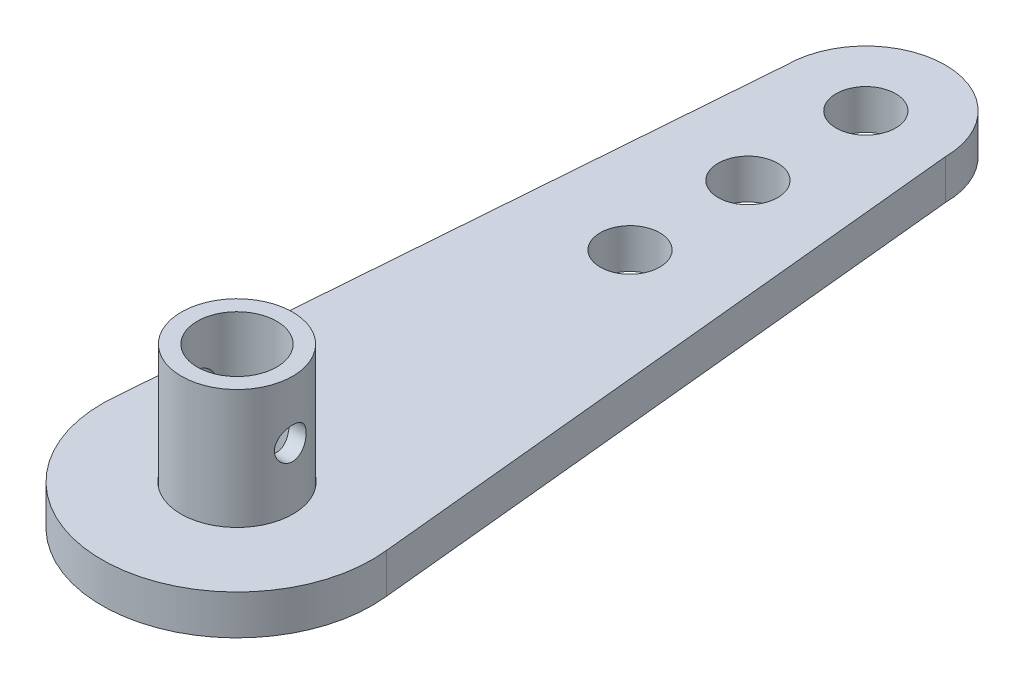
ISO-10303-21;
HEADER;
FILE_DESCRIPTION(('STEP AP214'),'2;1');
FILE_NAME('part.step','',(''),(''),'','','');
FILE_SCHEMA(('AUTOMOTIVE_DESIGN { 1 0 10303 214 1 1 1 1 }'));
ENDSEC;
DATA;
#1=APPLICATION_CONTEXT('core data for automotive mechanical design processes');
#2=APPLICATION_PROTOCOL_DEFINITION('international standard','automotive_design',2000,#1);
#3=PRODUCT_CONTEXT('',#1,'mechanical');
#4=PRODUCT('Part','Part','',(#3));
#5=PRODUCT_RELATED_PRODUCT_CATEGORY('part','',(#4));
#6=PRODUCT_DEFINITION_FORMATION('','',#4);
#7=PRODUCT_DEFINITION_CONTEXT('part definition',#1,'design');
#8=PRODUCT_DEFINITION('design','',#6,#7);
#9=PRODUCT_DEFINITION_SHAPE('','',#8);
#10=(LENGTH_UNIT() NAMED_UNIT(*) SI_UNIT(.MILLI.,.METRE.));
#11=(NAMED_UNIT(*) PLANE_ANGLE_UNIT() SI_UNIT($,.RADIAN.));
#12=(NAMED_UNIT(*) SI_UNIT($,.STERADIAN.) SOLID_ANGLE_UNIT());
#13=UNCERTAINTY_MEASURE_WITH_UNIT(LENGTH_MEASURE(1.E-05),#10,'distance_accuracy_value','');
#14=(GEOMETRIC_REPRESENTATION_CONTEXT(3) GLOBAL_UNCERTAINTY_ASSIGNED_CONTEXT((#13)) GLOBAL_UNIT_ASSIGNED_CONTEXT((#10,
#11,#12)) REPRESENTATION_CONTEXT('',''));
#15=CARTESIAN_POINT('',(0.,0.,0.));
#16=DIRECTION('',(0.,0.,1.));
#17=DIRECTION('',(1.,0.,0.));
#18=AXIS2_PLACEMENT_3D('',#15,#16,#17);
#19=CARTESIAN_POINT('',(0.,-49.5979797464467,0.));
#20=DIRECTION('',(0.,1.,0.));
#21=DIRECTION('',(0.,0.,1.));
#22=AXIS2_PLACEMENT_3D('',#19,#20,#21);
#23=CYLINDRICAL_SURFACE('',#22,14.);
#24=CARTESIAN_POINT('',(-13.4164078649987,15.4,-4.));
#25=CARTESIAN_POINT('',(-13.4164109402242,15.1802969242428,-3.99999604092983));
#26=CARTESIAN_POINT('',(-13.4218635935922,14.9605538314903,-3.98183733199153));
#27=CARTESIAN_POINT('',(-13.443007784134,14.5274575222748,-3.90984726780337));
#28=CARTESIAN_POINT('',(-13.4587034859276,14.3141069417989,-3.85600140272654));
#29=CARTESIAN_POINT('',(-13.4984141904331,13.9001255982568,-3.71458686585747));
#30=CARTESIAN_POINT('',(-13.522416305148,13.6994756963657,-3.62707041303752));
#31=CARTESIAN_POINT('',(-13.5760184219223,13.3156643768913,-3.42096728125872));
#32=CARTESIAN_POINT('',(-13.6056190885037,13.1325050392439,-3.30237691332692));
#33=CARTESIAN_POINT('',(-13.6680356642832,12.7836168693703,-3.03384960196399));
#34=CARTESIAN_POINT('',(-13.700915119283,12.6184643957416,-2.88317842226499));
#35=CARTESIAN_POINT('',(-13.7656393102403,12.3153944333924,-2.55634249093854));
#36=CARTESIAN_POINT('',(-13.797483924673,12.1774801337543,-2.38017475831926));
#37=CARTESIAN_POINT('',(-13.8572666400303,11.930342703293,-2.00329206431518));
#38=CARTESIAN_POINT('',(-13.8851210900173,11.821700760498,-1.80218156752374));
#39=CARTESIAN_POINT('',(-13.9330508097106,11.6399964511681,-1.38361695047928));
#40=CARTESIAN_POINT('',(-13.9531275938173,11.5669271575195,-1.16616602175034));
#41=CARTESIAN_POINT('',(-13.9827903860047,11.4603310775206,-0.727117150242356));
#42=CARTESIAN_POINT('',(-13.992636540226,11.4258219565906,-0.505775596258082));
#43=CARTESIAN_POINT('',(-14.0016419131939,11.3942265322335,-0.0602402048438457));
#44=CARTESIAN_POINT('',(-14.0008031747798,11.3971330753253,0.163953079177104));
#45=CARTESIAN_POINT('',(-13.988720135266,11.439612749836,0.601960391470434));
#46=CARTESIAN_POINT('',(-13.9777774155205,11.4781232252759,0.815887092217865));
#47=CARTESIAN_POINT('',(-13.9470777266033,11.5889902049288,1.23410444435526));
#48=CARTESIAN_POINT('',(-13.9273202211265,11.6613487685244,1.43839450860111));
#49=CARTESIAN_POINT('',(-13.8807806354401,11.8386188016235,1.83414766745775));
#50=CARTESIAN_POINT('',(-13.8539241102349,11.943877555616,2.02544608770119));
#51=CARTESIAN_POINT('',(-13.7960553794886,12.1836891727967,2.38801448718132));
#52=CARTESIAN_POINT('',(-13.765042263868,12.3182484553355,2.55928006483334));
#53=CARTESIAN_POINT('',(-13.7009136603624,12.6184114212345,2.88326529709413));
#54=CARTESIAN_POINT('',(-13.6677625872738,12.7849388672001,3.03512315516461));
#55=CARTESIAN_POINT('',(-13.6040594758538,13.1414301837019,3.30898603150471));
#56=CARTESIAN_POINT('',(-13.5735076485331,13.3313959539352,3.43098862758458));
#57=CARTESIAN_POINT('',(-13.5183034958578,13.7314617689667,3.64246671969374));
#58=CARTESIAN_POINT('',(-13.4937002171629,13.9417104499801,3.73167475570956));
#59=CARTESIAN_POINT('',(-13.4537708861407,14.3751063268812,3.8731790298547));
#60=CARTESIAN_POINT('',(-13.4384421346475,14.5982497492809,3.92548600803625));
#61=CARTESIAN_POINT('',(-13.4193823043332,15.0429608486919,3.99014834401352));
#62=CARTESIAN_POINT('',(-13.415274226443,15.2643236338733,4.00380296315132));
#63=CARTESIAN_POINT('',(-13.4180831918272,15.7061766318346,3.99437993438907));
#64=CARTESIAN_POINT('',(-13.4249988598223,15.9266669500199,3.97130686849173));
#65=CARTESIAN_POINT('',(-13.4487086011028,16.3552824560478,3.89023562851965));
#66=CARTESIAN_POINT('',(-13.4652728593166,16.5635751720308,3.8330492436831));
#67=CARTESIAN_POINT('',(-13.506181278607,16.967603743995,3.6863032373283));
#68=CARTESIAN_POINT('',(-13.5305265622207,17.1633377832912,3.59673894453528));
#69=CARTESIAN_POINT('',(-13.5850037601899,17.5420441504336,3.38523930243255));
#70=CARTESIAN_POINT('',(-13.615263947623,17.7245808884044,3.26255783458265));
#71=CARTESIAN_POINT('',(-13.6778745309961,18.0669527468867,2.98920927369681));
#72=CARTESIAN_POINT('',(-13.7102253789521,18.2267829340243,2.83853611536273));
#73=CARTESIAN_POINT('',(-13.7746945487219,18.5247588365764,2.50741601993112));
#74=CARTESIAN_POINT('',(-13.8067681209229,18.6619899428375,2.3261354204811));
#75=CARTESIAN_POINT('',(-13.8659595409199,18.9040913627655,1.94237061411509));
#76=CARTESIAN_POINT('',(-13.8930776477082,19.0089633678447,1.73988751619636));
#77=CARTESIAN_POINT('',(-13.9391300969281,19.1823685740527,1.32086654591233));
#78=CARTESIAN_POINT('',(-13.9581261625449,19.2511767791723,1.10444959979927));
#79=CARTESIAN_POINT('',(-13.9860667924777,19.3512536038803,0.662491297099843));
#80=CARTESIAN_POINT('',(-13.9950139424605,19.3825318803626,0.436952303170864));
#81=CARTESIAN_POINT('',(-14.0017067000655,19.4059828679956,-0.00835647591804675));
#82=CARTESIAN_POINT('',(-13.9998340717793,19.3994882981657,-0.228051262099872));
#83=CARTESIAN_POINT('',(-13.9859813824433,19.3507234371794,-0.663090344844051));
#84=CARTESIAN_POINT('',(-13.974001805414,19.3084548592357,-0.87843484923522));
#85=CARTESIAN_POINT('',(-13.9413760372002,19.1901372780425,-1.29680826607902));
#86=CARTESIAN_POINT('',(-13.9208082809555,19.1143936421129,-1.49993006686952));
#87=CARTESIAN_POINT('',(-13.873141882877,18.9315476834282,-1.8906944055235));
#88=CARTESIAN_POINT('',(-13.8460422300653,18.8244405058124,-2.07833454116351));
#89=CARTESIAN_POINT('',(-13.7871791087733,18.5782053251535,-2.43886691270561));
#90=CARTESIAN_POINT('',(-13.7553009156092,18.4382198264351,-2.61115465600577));
#91=CARTESIAN_POINT('',(-13.690881299846,18.1317817490802,-2.93024244464514));
#92=CARTESIAN_POINT('',(-13.6583396961736,17.9653218577859,-3.07703542441088));
#93=CARTESIAN_POINT('',(-13.595280750434,17.6054061660498,-3.34481692055405));
#94=CARTESIAN_POINT('',(-13.5648390336962,17.411356105155,-3.46502633435707));
#95=CARTESIAN_POINT('',(-13.5105689049742,17.0049562695349,-3.67095887227717));
#96=CARTESIAN_POINT('',(-13.4867367939819,16.7926168178684,-3.75670129766751));
#97=CARTESIAN_POINT('',(-13.4511691914923,16.3846925995023,-3.88197068027303));
#98=CARTESIAN_POINT('',(-13.4382487767767,16.1906193037863,-3.92611799964084));
#99=CARTESIAN_POINT('',(-13.4208673892336,15.7977077633049,-3.98513214086754));
#100=CARTESIAN_POINT('',(-13.416405081374,15.5988702755402,-4.00000358366114));
#101=CARTESIAN_POINT('',(-13.4164078649987,15.4,-4.));
#102=B_SPLINE_CURVE_WITH_KNOTS('',3,(#24,#25,#26,#27,#28,#29,#30,#31,#32,#33,#34,#35,#36,#37,
#38,#39,#40,#41,#42,#43,#44,#45,#46,#47,#48,#49,#50,#51,#52,#53,#54,#55,#56,#57,#58,#59,#60,#61,
#62,#63,#64,#65,#66,#67,#68,#69,#70,#71,#72,#73,#74,#75,#76,#77,#78,#79,#80,#81,#82,#83,#84,#85,
#86,#87,#88,#89,#90,#91,#92,#93,#94,#95,#96,#97,#98,#99,#100,#101),.UNSPECIFIED.,.T.,.F.,(4,2,2,
2,2,2,2,2,2,2,2,2,2,2,2,2,2,2,2,2,2,2,2,2,2,2,2,2,2,2,2,2,2,2,2,2,2,2,4),(0.,0.658376684727899,
1.31702121923772,1.97464836747287,2.63235362201469,3.30714334413232,3.98201202476966,
4.66942966027692,5.35671338035412,6.02605802057484,6.69527469104836,7.34514075286843,
7.99504635893043,8.65205806756982,9.3092138636967,9.98943225386,10.6697058125952,
11.355410412628,12.0409153559206,12.70308726673,13.3651765740293,14.0121057931906,
14.6591283843812,15.322160120908,15.9853356924624,16.6709077675935,17.3564440017533,
18.0366737060221,18.7167283415931,19.3729379537416,20.0291161418718,20.6794282478446,
21.3298410709248,21.9995953749678,22.6695349983666,23.3570722485049,24.0442239444163,
24.6402657774332,25.2362135230433),.UNSPECIFIED.);
#103=CARTESIAN_POINT('',(-13.4164078649987,15.4,-4.));
#104=VERTEX_POINT('',#103);
#105=EDGE_CURVE('E97',#104,#104,#102,.T.);
#106=ORIENTED_EDGE('',*,*,#105,.F.);
#107=EDGE_LOOP('',(#106));
#108=FACE_BOUND('',#107,.T.);
#109=CARTESIAN_POINT('',(13.4164078649987,15.4,-4.));
#110=CARTESIAN_POINT('',(13.4164109402242,15.6197030757572,-3.99999604092983));
#111=CARTESIAN_POINT('',(13.4218635935922,15.8394461685097,-3.98183733199153));
#112=CARTESIAN_POINT('',(13.443007784134,16.2725424777252,-3.90984726780337));
#113=CARTESIAN_POINT('',(13.4587034859276,16.4858930582011,-3.85600140272654));
#114=CARTESIAN_POINT('',(13.4984141904331,16.8998744017432,-3.71458686585747));
#115=CARTESIAN_POINT('',(13.522416305148,17.1005243036343,-3.62707041303752));
#116=CARTESIAN_POINT('',(13.5760184219223,17.4843356231087,-3.42096728125872));
#117=CARTESIAN_POINT('',(13.6056190885037,17.667494960756,-3.30237691332692));
#118=CARTESIAN_POINT('',(13.6680356642832,18.0163831306297,-3.03384960196399));
#119=CARTESIAN_POINT('',(13.700915119283,18.1815356042584,-2.88317842226499));
#120=CARTESIAN_POINT('',(13.7656393102403,18.4846055666076,-2.55634249093854));
#121=CARTESIAN_POINT('',(13.797483924673,18.6225198662457,-2.38017475831926));
#122=CARTESIAN_POINT('',(13.8572666400303,18.869657296707,-2.00329206431518));
#123=CARTESIAN_POINT('',(13.8851210900173,18.978299239502,-1.80218156752374));
#124=CARTESIAN_POINT('',(13.9330508097106,19.1600035488319,-1.38361695047928));
#125=CARTESIAN_POINT('',(13.9531275938173,19.2330728424805,-1.16616602175035));
#126=CARTESIAN_POINT('',(13.9827903860047,19.3396689224794,-0.72711715024236));
#127=CARTESIAN_POINT('',(13.992636540226,19.3741780434093,-0.505775596258087));
#128=CARTESIAN_POINT('',(14.0016419131939,19.4057734677665,-0.0602402048438502));
#129=CARTESIAN_POINT('',(14.0008031747798,19.4028669246747,0.163953079177099));
#130=CARTESIAN_POINT('',(13.988720135266,19.360387250164,0.60196039147043));
#131=CARTESIAN_POINT('',(13.9777774155205,19.3218767747241,0.815887092217861));
#132=CARTESIAN_POINT('',(13.9470777266033,19.2110097950712,1.23410444435525));
#133=CARTESIAN_POINT('',(13.9273202211265,19.1386512314756,1.43839450860111));
#134=CARTESIAN_POINT('',(13.8807806354401,18.9613811983765,1.83414766745775));
#135=CARTESIAN_POINT('',(13.8539241102349,18.856122444384,2.02544608770119));
#136=CARTESIAN_POINT('',(13.7960553794886,18.6163108272033,2.38801448718132));
#137=CARTESIAN_POINT('',(13.765042263868,18.4817515446645,2.55928006483334));
#138=CARTESIAN_POINT('',(13.7009136603624,18.1815885787654,2.88326529709413));
#139=CARTESIAN_POINT('',(13.6677625872738,18.0150611327999,3.0351231551646));
#140=CARTESIAN_POINT('',(13.6040594758538,17.6585698162981,3.30898603150471));
#141=CARTESIAN_POINT('',(13.5735076485331,17.4686040460648,3.43098862758458));
#142=CARTESIAN_POINT('',(13.5183034958578,17.0685382310333,3.64246671969374));
#143=CARTESIAN_POINT('',(13.4937002171629,16.8582895500199,3.73167475570955));
#144=CARTESIAN_POINT('',(13.4537708861407,16.4248936731188,3.8731790298547));
#145=CARTESIAN_POINT('',(13.4384421346475,16.2017502507191,3.92548600803625));
#146=CARTESIAN_POINT('',(13.4193823043332,15.7570391513081,3.99014834401352));
#147=CARTESIAN_POINT('',(13.415274226443,15.5356763661267,4.00380296315132));
#148=CARTESIAN_POINT('',(13.4180831918272,15.0938233681654,3.99437993438907));
#149=CARTESIAN_POINT('',(13.4249988598223,14.8733330499801,3.97130686849173));
#150=CARTESIAN_POINT('',(13.4487086011028,14.4447175439522,3.89023562851965));
#151=CARTESIAN_POINT('',(13.4652728593166,14.2364248279692,3.8330492436831));
#152=CARTESIAN_POINT('',(13.506181278607,13.832396256005,3.6863032373283));
#153=CARTESIAN_POINT('',(13.5305265622207,13.6366622167088,3.59673894453528));
#154=CARTESIAN_POINT('',(13.5850037601899,13.2579558495664,3.38523930243255));
#155=CARTESIAN_POINT('',(13.615263947623,13.0754191115956,3.26255783458265));
#156=CARTESIAN_POINT('',(13.6778745309961,12.7330472531133,2.98920927369681));
#157=CARTESIAN_POINT('',(13.7102253789521,12.5732170659757,2.83853611536273));
#158=CARTESIAN_POINT('',(13.7746945487219,12.2752411634236,2.50741601993112));
#159=CARTESIAN_POINT('',(13.8067681209229,12.1380100571625,2.3261354204811));
#160=CARTESIAN_POINT('',(13.8659595409199,11.8959086372345,1.94237061411509));
#161=CARTESIAN_POINT('',(13.8930776477082,11.7910366321552,1.73988751619637));
#162=CARTESIAN_POINT('',(13.9391300969281,11.6176314259473,1.32086654591234));
#163=CARTESIAN_POINT('',(13.9581261625449,11.5488232208277,1.10444959979928));
#164=CARTESIAN_POINT('',(13.9860667924777,11.4487463961196,0.662491297099847));
#165=CARTESIAN_POINT('',(13.9950139424605,11.4174681196374,0.436952303170867));
#166=CARTESIAN_POINT('',(14.0017067000655,11.3940171320044,-0.00835647591804526));
#167=CARTESIAN_POINT('',(13.9998340717793,11.4005117018343,-0.22805126209987));
#168=CARTESIAN_POINT('',(13.9859813824433,11.4492765628206,-0.663090344844048));
#169=CARTESIAN_POINT('',(13.974001805414,11.4915451407643,-0.878434849235216));
#170=CARTESIAN_POINT('',(13.9413760372002,11.6098627219575,-1.29680826607902));
#171=CARTESIAN_POINT('',(13.9208082809555,11.6856063578871,-1.49993006686952));
#172=CARTESIAN_POINT('',(13.873141882877,11.8684523165718,-1.8906944055235));
#173=CARTESIAN_POINT('',(13.8460422300653,11.9755594941876,-2.07833454116351));
#174=CARTESIAN_POINT('',(13.7871791087733,12.2217946748465,-2.4388669127056));
#175=CARTESIAN_POINT('',(13.7553009156092,12.3617801735649,-2.61115465600577));
#176=CARTESIAN_POINT('',(13.690881299846,12.6682182509198,-2.93024244464514));
#177=CARTESIAN_POINT('',(13.6583396961736,12.8346781422141,-3.07703542441088));
#178=CARTESIAN_POINT('',(13.595280750434,13.1945938339502,-3.34481692055405));
#179=CARTESIAN_POINT('',(13.5648390336962,13.388643894845,-3.46502633435707));
#180=CARTESIAN_POINT('',(13.5105689049742,13.7950437304651,-3.67095887227716));
#181=CARTESIAN_POINT('',(13.4867367939819,14.0073831821316,-3.75670129766751));
#182=CARTESIAN_POINT('',(13.4511691914923,14.4153074004976,-3.88197068027303));
#183=CARTESIAN_POINT('',(13.4382487767767,14.6093806962137,-3.92611799964084));
#184=CARTESIAN_POINT('',(13.4208673892336,15.0022922366951,-3.98513214086754));
#185=CARTESIAN_POINT('',(13.416405081374,15.2011297244598,-4.00000358366114));
#186=CARTESIAN_POINT('',(13.4164078649987,15.4,-4.));
#187=B_SPLINE_CURVE_WITH_KNOTS('',3,(#109,#110,#111,#112,#113,#114,#115,#116,#117,#118,#119,
#120,#121,#122,#123,#124,#125,#126,#127,#128,#129,#130,#131,#132,#133,#134,#135,#136,#137,#138,
#139,#140,#141,#142,#143,#144,#145,#146,#147,#148,#149,#150,#151,#152,#153,#154,#155,#156,#157,
#158,#159,#160,#161,#162,#163,#164,#165,#166,#167,#168,#169,#170,#171,#172,#173,#174,#175,#176,
#177,#178,#179,#180,#181,#182,#183,#184,#185,#186),.UNSPECIFIED.,.T.,.F.,(4,2,2,2,2,2,2,2,2,2,2,
2,2,2,2,2,2,2,2,2,2,2,2,2,2,2,2,2,2,2,2,2,2,2,2,2,2,2,4),(0.,0.6583766847279,1.31702121923772,
1.97464836747287,2.63235362201469,3.30714334413233,3.98201202476966,4.66942966027692,
5.35671338035411,6.02605802057483,6.69527469104835,7.34514075286842,7.99504635893043,
8.65205806756982,9.3092138636967,9.98943225386,10.6697058125952,11.355410412628,
12.0409153559206,12.70308726673,13.3651765740293,14.0121057931906,14.6591283843812,
15.322160120908,15.9853356924624,16.6709077675935,17.3564440017533,18.0366737060221,
18.7167283415931,19.3729379537415,20.0291161418718,20.6794282478446,21.3298410709248,
21.9995953749678,22.6695349983666,23.3570722485049,24.0442239444163,24.6402657774332,
25.2362135230433),.UNSPECIFIED.);
#188=CARTESIAN_POINT('',(13.4164078649987,15.4,-4.));
#189=VERTEX_POINT('',#188);
#190=EDGE_CURVE('E92',#189,#189,#187,.T.);
#191=ORIENTED_EDGE('',*,*,#190,.F.);
#192=EDGE_LOOP('',(#191));
#193=FACE_BOUND('',#192,.T.);
#194=CARTESIAN_POINT('',(0.,-10.,0.));
#195=DIRECTION('',(0.,1.,0.));
#196=DIRECTION('',(0.,0.,1.));
#197=AXIS2_PLACEMENT_3D('',#194,#195,#196);
#198=CIRCLE('',#197,14.);
#199=CARTESIAN_POINT('',(0.,-10.,14.));
#200=VERTEX_POINT('',#199);
#201=EDGE_CURVE('E11',#200,#200,#198,.F.);
#202=ORIENTED_EDGE('',*,*,#201,.F.);
#203=EDGE_LOOP('',(#202));
#204=FACE_BOUND('',#203,.T.);
#205=CARTESIAN_POINT('',(0.,30.,0.));
#206=DIRECTION('',(0.,1.,0.));
#207=DIRECTION('',(0.,0.,1.));
#208=AXIS2_PLACEMENT_3D('',#205,#206,#207);
#209=CIRCLE('',#208,14.);
#210=CARTESIAN_POINT('',(0.,30.,14.));
#211=VERTEX_POINT('',#210);
#212=EDGE_CURVE('E68',#211,#211,#209,.T.);
#213=ORIENTED_EDGE('',*,*,#212,.F.);
#214=EDGE_LOOP('',(#213));
#215=FACE_BOUND('',#214,.T.);
#216=ADVANCED_FACE('F51',(#108,#193,#204,#215),#23,.T.);
#217=CARTESIAN_POINT('',(0.,-49.5979797464467,0.));
#218=DIRECTION('',(0.,1.,0.));
#219=DIRECTION('',(0.,0.,1.));
#220=AXIS2_PLACEMENT_3D('',#217,#218,#219);
#221=CYLINDRICAL_SURFACE('',#220,10.);
#222=CARTESIAN_POINT('',(-9.16515138991168,15.4,-4.));
#223=CARTESIAN_POINT('',(-9.16515220722505,15.2928225032156,-3.99999917996685));
#224=CARTESIAN_POINT('',(-9.16703782704588,15.1856121402052,-3.99568627578832));
#225=CARTESIAN_POINT('',(-9.17451890581268,14.9719679058293,-3.97847804504315));
#226=CARTESIAN_POINT('',(-9.18011663538446,14.8655345500547,-3.965577465543));
#227=CARTESIAN_POINT('',(-9.19485078616074,14.6540640466445,-3.9312935770878));
#228=CARTESIAN_POINT('',(-9.20399425848326,14.5490301151513,-3.90989336356571));
#229=CARTESIAN_POINT('',(-9.2255144619826,14.3413124028102,-3.85883937208579));
#230=CARTESIAN_POINT('',(-9.23789253541712,14.2386296168982,-3.82918216740128));
#231=CARTESIAN_POINT('',(-9.27920231487636,13.9360102733714,-3.72849978450445));
#232=CARTESIAN_POINT('',(-9.31238810193525,13.7404620790357,-3.64559228099563));
#233=CARTESIAN_POINT('',(-9.38629512671437,13.366198731327,-3.45083256453888));
#234=CARTESIAN_POINT('',(-9.42701471853534,13.1874799141088,-3.33898667159604));
#235=CARTESIAN_POINT('',(-9.51401677460926,12.8414881863986,-3.08264624953203));
#236=CARTESIAN_POINT('',(-9.56047821792022,12.675289566711,-2.93675933272146));
#237=CARTESIAN_POINT('',(-9.65224928088018,12.3689395919581,-2.61941759406606));
#238=CARTESIAN_POINT('',(-9.69755849326326,12.228797339245,-2.44795387495429));
#239=CARTESIAN_POINT('',(-9.78406811808174,11.9731878901629,-2.07601279575004));
#240=CARTESIAN_POINT('',(-9.82503606295845,11.8589115800306,-1.87465797803874));
#241=CARTESIAN_POINT('',(-9.89607856333948,11.6663126803231,-1.45365059895514));
#242=CARTESIAN_POINT('',(-9.92615755049622,11.5879754605668,-1.23400552632834));
#243=CARTESIAN_POINT('',(-9.97076649749865,11.473317072677,-0.793932865332425));
#244=CARTESIAN_POINT('',(-9.98597873479395,11.4351453840019,-0.57405797272552));
#245=CARTESIAN_POINT('',(-10.001606214367,11.3959430164992,-0.130532654160154));
#246=CARTESIAN_POINT('',(-10.0020269755724,11.3948984849555,0.093116332463124));
#247=CARTESIAN_POINT('',(-9.98843925626005,11.4289655425465,0.524464988663935));
#248=CARTESIAN_POINT('',(-9.9752399353889,11.4620495462971,0.73235490554246));
#249=CARTESIAN_POINT('',(-9.93698582942363,11.5599857518182,1.1393462186423));
#250=CARTESIAN_POINT('',(-9.91193017443785,11.6248402845844,1.33844696883604));
#251=CARTESIAN_POINT('',(-9.85193648913816,11.7852729659723,1.72579587696675));
#252=CARTESIAN_POINT('',(-9.81685520932146,11.8812994296887,1.91383524674319));
#253=CARTESIAN_POINT('',(-9.7402917036085,12.1009300137803,2.27161630149723));
#254=CARTESIAN_POINT('',(-9.69880728534381,12.2245435861843,2.44135168543995));
#255=CARTESIAN_POINT('',(-9.61043274352157,12.5052982719048,2.76953765597606));
#256=CARTESIAN_POINT('',(-9.56336653023493,12.6641077851502,2.92651569053149));
#257=CARTESIAN_POINT('',(-9.4712332194655,13.0059811436594,3.21221483078645));
#258=CARTESIAN_POINT('',(-9.42616678016159,13.18905289639,3.34092668757428));
#259=CARTESIAN_POINT('',(-9.3419379481804,13.5808380447492,3.56980837743822));
#260=CARTESIAN_POINT('',(-9.30297828115414,13.7901296606776,3.66906930327244));
#261=CARTESIAN_POINT('',(-9.23775180688171,14.2244309806241,3.83035251973301));
#262=CARTESIAN_POINT('',(-9.21147675782622,14.4494303694531,3.89239899675599));
#263=CARTESIAN_POINT('',(-9.17659519405432,14.8940715549349,3.97390989770977));
#264=CARTESIAN_POINT('',(-9.16700732912275,15.1132008942571,3.99574419362908));
#265=CARTESIAN_POINT('',(-9.16378995738077,15.5521544155191,4.00312265288578));
#266=CARTESIAN_POINT('',(-9.17015561120724,15.7719783665513,3.98867782118257));
#267=CARTESIAN_POINT('',(-9.19712088718227,16.1929178699139,3.92606578958006));
#268=CARTESIAN_POINT('',(-9.21688915596603,16.3943858748,3.87986612404771));
#269=CARTESIAN_POINT('',(-9.2674010205468,16.786576809571,3.75760837382175));
#270=CARTESIAN_POINT('',(-9.29814704977196,16.9772973462148,3.68154366860459));
#271=CARTESIAN_POINT('',(-9.36867563720203,17.3512047155908,3.49827127896311));
#272=CARTESIAN_POINT('',(-9.40877409278357,17.5337723773872,3.38992573652914));
#273=CARTESIAN_POINT('',(-9.49300770315588,17.878965974885,3.14633044888379));
#274=CARTESIAN_POINT('',(-9.5371444979208,18.0415837455978,3.01106974696435));
#275=CARTESIAN_POINT('',(-9.62841831942843,18.3547468171913,2.70568842336055));
#276=CARTESIAN_POINT('',(-9.67553614570507,18.5035131305545,2.53373085888854));
#277=CARTESIAN_POINT('',(-9.76439589135024,18.7703541532482,2.16616726673934));
#278=CARTESIAN_POINT('',(-9.80613759186121,18.8884276132975,1.97056027694192));
#279=CARTESIAN_POINT('',(-9.87967431800929,19.0900952528195,1.56055986799732));
#280=CARTESIAN_POINT('',(-9.9114717248188,19.1736976879472,1.346170961965));
#281=CARTESIAN_POINT('',(-9.96145426937248,19.3030977051994,0.904787181861566));
#282=CARTESIAN_POINT('',(-9.97964679410119,19.3489158043134,0.677799220674797));
#283=CARTESIAN_POINT('',(-9.99958016425668,19.399009401911,0.233633020611973));
#284=CARTESIAN_POINT('',(-10.0023169350655,19.4058002520768,0.0167809848943024));
#285=CARTESIAN_POINT('',(-9.99372084740381,19.3842890462796,-0.414867671174726));
#286=CARTESIAN_POINT('',(-9.98239011871255,19.3559923024791,-0.629664597702893));
#287=CARTESIAN_POINT('',(-9.94743026789157,19.2669064057872,-1.04434180494581));
#288=CARTESIAN_POINT('',(-9.92418961491739,19.2071420434949,-1.2444776131699));
#289=CARTESIAN_POINT('',(-9.86789895440956,19.0578944552422,-1.63184470564404));
#290=CARTESIAN_POINT('',(-9.83484713776136,18.968405747944,-1.81907360209111));
#291=CARTESIAN_POINT('',(-9.76036189588764,18.7577933524316,-2.18440609879393));
#292=CARTESIAN_POINT('',(-9.71862262764552,18.6354464559039,-2.3617408310488));
#293=CARTESIAN_POINT('',(-9.63178803063432,18.3644239163639,-2.69410799958838));
#294=CARTESIAN_POINT('',(-9.58669131729773,18.2157373759609,-2.849131156699));
#295=CARTESIAN_POINT('',(-9.49475540255923,17.8853657611342,-3.14240275826141));
#296=CARTESIAN_POINT('',(-9.4479811565371,17.702207701298,-3.27901865020172));
#297=CARTESIAN_POINT('',(-9.36099292501489,17.3141302787523,-3.51969402497222));
#298=CARTESIAN_POINT('',(-9.32077971107738,17.1092083613338,-3.62374968011083));
#299=CARTESIAN_POINT('',(-9.25517900642369,16.7018760562204,-3.78798515690828));
#300=CARTESIAN_POINT('',(-9.22878451494603,16.5008923240541,-3.85126569346866));
#301=CARTESIAN_POINT('',(-9.1988556584339,16.1933610402093,-3.92194632104984));
#302=CARTESIAN_POINT('',(-9.19049270633767,16.0899269641056,-3.94146052144918));
#303=CARTESIAN_POINT('',(-9.17721200341611,15.8816430703891,-3.97228850679684));
#304=CARTESIAN_POINT('',(-9.17229225293171,15.7767941106041,-3.98360705155155));
#305=CARTESIAN_POINT('',(-9.16783675423417,15.6264494086476,-3.99384232103284));
#306=CARTESIAN_POINT('',(-9.16683059815414,15.5812001696778,-3.99615058414993));
#307=CARTESIAN_POINT('',(-9.16548771864777,15.4906359157854,-3.99922965337524));
#308=CARTESIAN_POINT('',(-9.16515104430391,15.4453208962838,-4.00000034675784));
#309=CARTESIAN_POINT('',(-9.16515138991168,15.4,-4.));
#310=B_SPLINE_CURVE_WITH_KNOTS('',3,(#222,#223,#224,#225,#226,#227,#228,#229,#230,#231,#232,
#233,#234,#235,#236,#237,#238,#239,#240,#241,#242,#243,#244,#245,#246,#247,#248,#249,#250,#251,
#252,#253,#254,#255,#256,#257,#258,#259,#260,#261,#262,#263,#264,#265,#266,#267,#268,#269,#270,
#271,#272,#273,#274,#275,#276,#277,#278,#279,#280,#281,#282,#283,#284,#285,#286,#287,#288,#289,
#290,#291,#292,#293,#294,#295,#296,#297,#298,#299,#300,#301,#302,#303,#304,#305,#306,#307,#308,
#309),.UNSPECIFIED.,.T.,.F.,(4,2,2,2,2,2,2,2,2,2,2,2,2,2,2,2,2,2,2,2,2,2,2,2,2,2,2,2,2,2,2,2,2,
2,2,2,2,2,2,2,2,2,2,4),(0.,0.321486083338405,0.643168995111192,0.965494918272706,
1.28795480954363,1.92974178448592,2.57138871437637,3.24631250358764,3.92147162486599,
4.62325351972771,5.32474947728875,5.99228379564282,6.65956904401259,7.28937303450519,
7.91922324048033,8.55856614259711,9.19812843669977,9.87968101952626,10.5614562804417,
11.2624893122443,11.9630662339012,12.6208430883876,13.2784204360579,13.898545099602,
14.5188073109319,15.1642232309532,15.8099024284161,16.5032748228387,17.1966754349541,
17.8899098841554,18.5827676569819,19.2304209330182,19.8779761681512,20.5056400267662,
21.1334196944708,21.7889411606976,22.4447344691833,23.1411252036114,23.8375977730829,
24.4715333542807,24.7879924179097,25.1042675432749,25.240200643082,25.3761437083411),.UNSPECIFIED.);
#311=CARTESIAN_POINT('',(-9.16515138991168,15.4,-4.));
#312=VERTEX_POINT('',#311);
#313=EDGE_CURVE('E55',#312,#312,#310,.T.);
#314=ORIENTED_EDGE('',*,*,#313,.T.);
#315=EDGE_LOOP('',(#314));
#316=FACE_BOUND('',#315,.T.);
#317=CARTESIAN_POINT('',(9.16515138991169,15.4,-4.));
#318=CARTESIAN_POINT('',(9.16515220722508,15.5071774967844,-3.99999917996685));
#319=CARTESIAN_POINT('',(9.16703782704589,15.6143878597948,-3.99568627578832));
#320=CARTESIAN_POINT('',(9.17451890581268,15.8280320941707,-3.97847804504315));
#321=CARTESIAN_POINT('',(9.18011663538446,15.9344654499453,-3.965577465543));
#322=CARTESIAN_POINT('',(9.19485078616074,16.1459359533555,-3.9312935770878));
#323=CARTESIAN_POINT('',(9.20399425848326,16.2509698848487,-3.90989336356571));
#324=CARTESIAN_POINT('',(9.2255144619826,16.4586875971898,-3.85883937208579));
#325=CARTESIAN_POINT('',(9.23789253541712,16.5613703831018,-3.82918216740128));
#326=CARTESIAN_POINT('',(9.27920231487636,16.8639897266286,-3.72849978450445));
#327=CARTESIAN_POINT('',(9.31238810193525,17.0595379209643,-3.64559228099563));
#328=CARTESIAN_POINT('',(9.38629512671437,17.433801268673,-3.45083256453889));
#329=CARTESIAN_POINT('',(9.42701471853534,17.6125200858912,-3.33898667159604));
#330=CARTESIAN_POINT('',(9.51401677460926,17.9585118136014,-3.08264624953203));
#331=CARTESIAN_POINT('',(9.56047821792022,18.124710433289,-2.93675933272146));
#332=CARTESIAN_POINT('',(9.65224928088017,18.4310604080419,-2.61941759406606));
#333=CARTESIAN_POINT('',(9.69755849326326,18.571202660755,-2.44795387495429));
#334=CARTESIAN_POINT('',(9.78406811808173,18.8268121098371,-2.07601279575005));
#335=CARTESIAN_POINT('',(9.82503606295845,18.9410884199694,-1.87465797803874));
#336=CARTESIAN_POINT('',(9.89607856333948,19.1336873196769,-1.45365059895515));
#337=CARTESIAN_POINT('',(9.92615755049622,19.2120245394332,-1.23400552632834));
#338=CARTESIAN_POINT('',(9.97076649749865,19.326682927323,-0.793932865332433));
#339=CARTESIAN_POINT('',(9.98597873479395,19.3648546159981,-0.574057972725528));
#340=CARTESIAN_POINT('',(10.001606214367,19.4040569835008,-0.130532654160162));
#341=CARTESIAN_POINT('',(10.0020269755724,19.4051015150445,0.0931163324631166));
#342=CARTESIAN_POINT('',(9.98843925626006,19.3710344574535,0.524464988663928));
#343=CARTESIAN_POINT('',(9.97523993538891,19.3379504537029,0.732354905542455));
#344=CARTESIAN_POINT('',(9.93698582942363,19.2400142481818,1.1393462186423));
#345=CARTESIAN_POINT('',(9.91193017443785,19.1751597154156,1.33844696883603));
#346=CARTESIAN_POINT('',(9.85193648913816,19.0147270340277,1.72579587696675));
#347=CARTESIAN_POINT('',(9.81685520932147,18.9187005703113,1.91383524674319));
#348=CARTESIAN_POINT('',(9.7402917036085,18.6990699862197,2.27161630149723));
#349=CARTESIAN_POINT('',(9.69880728534381,18.5754564138157,2.44135168543995));
#350=CARTESIAN_POINT('',(9.61043274352157,18.2947017280952,2.76953765597606));
#351=CARTESIAN_POINT('',(9.56336653023493,18.1358922148498,2.92651569053149));
#352=CARTESIAN_POINT('',(9.4712332194655,17.7940188563406,3.21221483078645));
#353=CARTESIAN_POINT('',(9.42616678016159,17.61094710361,3.34092668757428));
#354=CARTESIAN_POINT('',(9.3419379481804,17.2191619552508,3.56980837743822));
#355=CARTESIAN_POINT('',(9.30297828115414,17.0098703393224,3.66906930327244));
#356=CARTESIAN_POINT('',(9.23775180688171,16.5755690193759,3.83035251973301));
#357=CARTESIAN_POINT('',(9.21147675782622,16.3505696305469,3.89239899675599));
#358=CARTESIAN_POINT('',(9.17659519405432,15.905928445065,3.97390989770977));
#359=CARTESIAN_POINT('',(9.16700732912275,15.6867991057429,3.99574419362908));
#360=CARTESIAN_POINT('',(9.16378995738077,15.2478455844809,4.00312265288578));
#361=CARTESIAN_POINT('',(9.17015561120724,15.0280216334487,3.98867782118257));
#362=CARTESIAN_POINT('',(9.19712088718227,14.6070821300861,3.92606578958006));
#363=CARTESIAN_POINT('',(9.21688915596603,14.4056141252,3.87986612404771));
#364=CARTESIAN_POINT('',(9.26740102054679,14.013423190429,3.75760837382175));
#365=CARTESIAN_POINT('',(9.29814704977195,13.8227026537852,3.68154366860459));
#366=CARTESIAN_POINT('',(9.36867563720203,13.4487952844092,3.49827127896311));
#367=CARTESIAN_POINT('',(9.40877409278357,13.2662276226128,3.38992573652915));
#368=CARTESIAN_POINT('',(9.49300770315587,12.921034025115,3.1463304488838));
#369=CARTESIAN_POINT('',(9.5371444979208,12.7584162544022,3.01106974696435));
#370=CARTESIAN_POINT('',(9.62841831942843,12.4452531828087,2.70568842336056));
#371=CARTESIAN_POINT('',(9.67553614570507,12.2964868694455,2.53373085888855));
#372=CARTESIAN_POINT('',(9.76439589135024,12.0296458467518,2.16616726673934));
#373=CARTESIAN_POINT('',(9.80613759186121,11.9115723867025,1.97056027694193));
#374=CARTESIAN_POINT('',(9.87967431800929,11.7099047471805,1.56055986799733));
#375=CARTESIAN_POINT('',(9.9114717248188,11.6263023120528,1.346170961965));
#376=CARTESIAN_POINT('',(9.96145426937248,11.4969022948006,0.904787181861569));
#377=CARTESIAN_POINT('',(9.97964679410119,11.4510841956866,0.6777992206748));
#378=CARTESIAN_POINT('',(9.99958016425668,11.400990598089,0.233633020611976));
#379=CARTESIAN_POINT('',(10.0023169350655,11.3941997479232,0.0167809848943062));
#380=CARTESIAN_POINT('',(9.99372084740381,11.4157109537204,-0.414867671174723));
#381=CARTESIAN_POINT('',(9.98239011871255,11.4440076975209,-0.629664597702889));
#382=CARTESIAN_POINT('',(9.94743026789157,11.5330935942128,-1.0443418049458));
#383=CARTESIAN_POINT('',(9.92418961491739,11.592857956505,-1.2444776131699));
#384=CARTESIAN_POINT('',(9.86789895440956,11.7421055447578,-1.63184470564403));
#385=CARTESIAN_POINT('',(9.83484713776136,11.831594252056,-1.81907360209111));
#386=CARTESIAN_POINT('',(9.76036189588764,12.0422066475684,-2.18440609879393));
#387=CARTESIAN_POINT('',(9.71862262764551,12.1645535440961,-2.3617408310488));
#388=CARTESIAN_POINT('',(9.63178803063432,12.4355760836361,-2.69410799958838));
#389=CARTESIAN_POINT('',(9.58669131729773,12.5842626240391,-2.84913115669899));
#390=CARTESIAN_POINT('',(9.49475540255924,12.9146342388658,-3.14240275826141));
#391=CARTESIAN_POINT('',(9.4479811565371,13.097792298702,-3.27901865020172));
#392=CARTESIAN_POINT('',(9.36099292501489,13.4858697212477,-3.51969402497221));
#393=CARTESIAN_POINT('',(9.32077971107738,13.6907916386662,-3.62374968011082));
#394=CARTESIAN_POINT('',(9.25517900642369,14.0981239437796,-3.78798515690828));
#395=CARTESIAN_POINT('',(9.22878451494603,14.2991076759459,-3.85126569346865));
#396=CARTESIAN_POINT('',(9.1988556584339,14.6066389597907,-3.92194632104984));
#397=CARTESIAN_POINT('',(9.19049270633767,14.7100730358944,-3.94146052144918));
#398=CARTESIAN_POINT('',(9.17721200341611,14.9183569296109,-3.97228850679684));
#399=CARTESIAN_POINT('',(9.17229225293171,15.0232058893959,-3.98360705155155));
#400=CARTESIAN_POINT('',(9.16783675423417,15.1735505913524,-3.99384232103284));
#401=CARTESIAN_POINT('',(9.16683059815414,15.2187998303222,-3.99615058414993));
#402=CARTESIAN_POINT('',(9.16548771864777,15.3093640842146,-3.99922965337524));
#403=CARTESIAN_POINT('',(9.16515104430392,15.3546791037162,-4.00000034675784));
#404=CARTESIAN_POINT('',(9.16515138991169,15.4,-4.));
#405=B_SPLINE_CURVE_WITH_KNOTS('',3,(#317,#318,#319,#320,#321,#322,#323,#324,#325,#326,#327,
#328,#329,#330,#331,#332,#333,#334,#335,#336,#337,#338,#339,#340,#341,#342,#343,#344,#345,#346,
#347,#348,#349,#350,#351,#352,#353,#354,#355,#356,#357,#358,#359,#360,#361,#362,#363,#364,#365,
#366,#367,#368,#369,#370,#371,#372,#373,#374,#375,#376,#377,#378,#379,#380,#381,#382,#383,#384,
#385,#386,#387,#388,#389,#390,#391,#392,#393,#394,#395,#396,#397,#398,#399,#400,#401,#402,#403,
#404),.UNSPECIFIED.,.T.,.F.,(4,2,2,2,2,2,2,2,2,2,2,2,2,2,2,2,2,2,2,2,2,2,2,2,2,2,2,2,2,2,2,2,2,
2,2,2,2,2,2,2,2,2,2,4),(0.,0.321486083338403,0.643168995111192,0.965494918272705,
1.28795480954363,1.92974178448592,2.57138871437637,3.24631250358763,3.92147162486598,
4.6232535197277,5.32474947728874,5.99228379564281,6.65956904401258,7.28937303450519,
7.91922324048033,8.5585661425971,9.19812843669976,9.87968101952625,10.5614562804417,
11.2624893122443,11.9630662339012,12.6208430883876,13.2784204360579,13.898545099602,
14.5188073109319,15.1642232309532,15.8099024284161,16.5032748228387,17.1966754349541,
17.8899098841554,18.5827676569819,19.2304209330182,19.8779761681512,20.5056400267662,
21.1334196944708,21.7889411606976,22.4447344691833,23.1411252036114,23.8375977730829,
24.4715333542807,24.7879924179096,25.1042675432749,25.240200643082,25.3761437083411),.UNSPECIFIED.);
#406=CARTESIAN_POINT('',(9.16515138991169,15.4,-4.));
#407=VERTEX_POINT('',#406);
#408=EDGE_CURVE('E72',#407,#407,#405,.T.);
#409=ORIENTED_EDGE('',*,*,#408,.T.);
#410=EDGE_LOOP('',(#409));
#411=FACE_BOUND('',#410,.T.);
#412=CARTESIAN_POINT('',(0.,-10.,0.));
#413=DIRECTION('',(0.,1.,0.));
#414=DIRECTION('',(0.,0.,1.));
#415=AXIS2_PLACEMENT_3D('',#412,#413,#414);
#416=CIRCLE('',#415,10.);
#417=CARTESIAN_POINT('',(0.,-10.,10.));
#418=VERTEX_POINT('',#417);
#419=EDGE_CURVE('E63',#418,#418,#416,.F.);
#420=ORIENTED_EDGE('',*,*,#419,.T.);
#421=EDGE_LOOP('',(#420));
#422=FACE_BOUND('',#421,.T.);
#423=CARTESIAN_POINT('',(0.,30.,0.));
#424=DIRECTION('',(0.,1.,0.));
#425=DIRECTION('',(0.,0.,1.));
#426=AXIS2_PLACEMENT_3D('',#423,#424,#425);
#427=CIRCLE('',#426,10.);
#428=CARTESIAN_POINT('',(0.,30.,10.));
#429=VERTEX_POINT('',#428);
#430=EDGE_CURVE('E102',#429,#429,#427,.T.);
#431=ORIENTED_EDGE('',*,*,#430,.T.);
#432=EDGE_LOOP('',(#431));
#433=FACE_BOUND('',#432,.T.);
#434=ADVANCED_FACE('F77',(#316,#411,#422,#433),#221,.F.);
#435=CARTESIAN_POINT('',(0.,-10.,0.));
#436=DIRECTION('',(0.,1.,0.));
#437=DIRECTION('',(0.,0.,1.));
#438=AXIS2_PLACEMENT_3D('',#435,#436,#437);
#439=PLANE('',#438);
#440=ORIENTED_EDGE('',*,*,#201,.T.);
#441=EDGE_LOOP('',(#440));
#442=FACE_BOUND('',#441,.T.);
#443=ORIENTED_EDGE('',*,*,#419,.F.);
#444=EDGE_LOOP('',(#443));
#445=FACE_BOUND('',#444,.T.);
#446=ADVANCED_FACE('F117',(#442,#445),#439,.F.);
#447=CARTESIAN_POINT('',(0.,30.,0.));
#448=DIRECTION('',(0.,1.,0.));
#449=DIRECTION('',(0.,0.,1.));
#450=AXIS2_PLACEMENT_3D('',#447,#448,#449);
#451=PLANE('',#450);
#452=ORIENTED_EDGE('',*,*,#212,.T.);
#453=EDGE_LOOP('',(#452));
#454=FACE_BOUND('',#453,.T.);
#455=ORIENTED_EDGE('',*,*,#430,.F.);
#456=EDGE_LOOP('',(#455));
#457=FACE_BOUND('',#456,.T.);
#458=ADVANCED_FACE('F86',(#454,#457),#451,.T.);
#459=CARTESIAN_POINT('',(-34.,15.4,0.));
#460=DIRECTION('',(1.,0.,0.));
#461=DIRECTION('',(0.,0.,-1.));
#462=AXIS2_PLACEMENT_3D('',#459,#460,#461);
#463=CYLINDRICAL_SURFACE('',#462,4.);
#464=ORIENTED_EDGE('',*,*,#190,.T.);
#465=EDGE_LOOP('',(#464));
#466=FACE_BOUND('',#465,.T.);
#467=ORIENTED_EDGE('',*,*,#408,.F.);
#468=EDGE_LOOP('',(#467));
#469=FACE_BOUND('',#468,.T.);
#470=ADVANCED_FACE('F84',(#466,#469),#463,.F.);
#471=ORIENTED_EDGE('',*,*,#105,.T.);
#472=EDGE_LOOP('',(#471));
#473=FACE_BOUND('',#472,.T.);
#474=ORIENTED_EDGE('',*,*,#313,.F.);
#475=EDGE_LOOP('',(#474));
#476=FACE_BOUND('',#475,.T.);
#477=ADVANCED_FACE('F80',(#473,#476),#463,.F.);
#478=CLOSED_SHELL('',(#216,#434,#446,#458,#470,#477));
#479=MANIFOLD_SOLID_BREP('B2',#478);
#480=CARTESIAN_POINT('',(0.,-10.,0.));
#481=DIRECTION('',(0.,1.,0.));
#482=DIRECTION('',(0.,0.,1.));
#483=AXIS2_PLACEMENT_3D('',#480,#481,#482);
#484=CYLINDRICAL_SURFACE('',#483,34.);
#485=CARTESIAN_POINT('',(0.,0.,0.));
#486=DIRECTION('',(0.,1.,0.));
#487=DIRECTION('',(0.,0.,1.));
#488=AXIS2_PLACEMENT_3D('',#485,#486,#487);
#489=CIRCLE('',#488,34.);
#490=CARTESIAN_POINT('',(-33.7875080585711,0.,-3.79529961821116));
#491=VERTEX_POINT('',#490);
#492=CARTESIAN_POINT('',(33.7875080585711,0.,-3.79529961821113));
#493=VERTEX_POINT('',#492);
#494=EDGE_CURVE('E239',#491,#493,#489,.T.);
#495=ORIENTED_EDGE('',*,*,#494,.F.);
#496=DIRECTION('',(0.,1.,0.));
#497=VECTOR('',#496,1.);
#498=CARTESIAN_POINT('',(-33.7875080585711,-10.,-3.79529961821116));
#499=LINE('',#498,#497);
#500=CARTESIAN_POINT('',(-33.7875080585711,-10.,-3.79529961821116));
#501=VERTEX_POINT('',#500);
#502=EDGE_CURVE('E49',#501,#491,#499,.T.);
#503=ORIENTED_EDGE('',*,*,#502,.F.);
#504=CARTESIAN_POINT('',(0.,-10.,0.));
#505=DIRECTION('',(0.,1.,0.));
#506=DIRECTION('',(0.,0.,1.));
#507=AXIS2_PLACEMENT_3D('',#504,#505,#506);
#508=CIRCLE('',#507,34.);
#509=CARTESIAN_POINT('',(33.7875080585711,-10.,-3.79529961821113));
#510=VERTEX_POINT('',#509);
#511=EDGE_CURVE('E232',#501,#510,#508,.T.);
#512=ORIENTED_EDGE('',*,*,#511,.T.);
#513=DIRECTION('',(0.,1.,0.));
#514=VECTOR('',#513,1.);
#515=CARTESIAN_POINT('',(33.7875080585711,-10.,-3.79529961821113));
#516=LINE('',#515,#514);
#517=EDGE_CURVE('E177',#510,#493,#516,.T.);
#518=ORIENTED_EDGE('',*,*,#517,.T.);
#519=EDGE_LOOP('',(#495,#503,#512,#518));
#520=FACE_BOUND('',#519,.T.);
#521=ADVANCED_FACE('F174',(#520),#484,.T.);
#522=CARTESIAN_POINT('',(-21.7090679530478,-10.,-159.990871885654));
#523=DIRECTION('',(-0.997023459128104,0.,-0.0770987804587759));
#524=DIRECTION('',(-0.0770987804587759,0.,0.997023459128104));
#525=AXIS2_PLACEMENT_3D('',#522,#523,#524);
#526=PLANE('',#525);
#527=DIRECTION('',(-0.0770987804587759,0.,0.997023459128104));
#528=VECTOR('',#527,1.);
#529=CARTESIAN_POINT('',(-21.7090679530478,0.,-159.990871885654));
#530=LINE('',#529,#528);
#531=CARTESIAN_POINT('',(-21.7090679530478,0.,-159.990871885654));
#532=VERTEX_POINT('',#531);
#533=EDGE_CURVE('E234',#532,#491,#530,.T.);
#534=ORIENTED_EDGE('',*,*,#533,.F.);
#535=DIRECTION('',(0.,1.,0.));
#536=VECTOR('',#535,1.);
#537=CARTESIAN_POINT('',(-21.7090679530478,-10.,-159.990871885654));
#538=LINE('',#537,#536);
#539=CARTESIAN_POINT('',(-21.7090679530478,-10.,-159.990871885654));
#540=VERTEX_POINT('',#539);
#541=EDGE_CURVE('E183',#540,#532,#538,.T.);
#542=ORIENTED_EDGE('',*,*,#541,.F.);
#543=DIRECTION('',(-0.0770987804587759,0.,0.997023459128104));
#544=VECTOR('',#543,1.);
#545=CARTESIAN_POINT('',(-21.7090679530478,-10.,-159.990871885654));
#546=LINE('',#545,#544);
#547=EDGE_CURVE('E229',#540,#501,#546,.T.);
#548=ORIENTED_EDGE('',*,*,#547,.T.);
#549=ORIENTED_EDGE('',*,*,#502,.T.);
#550=EDGE_LOOP('',(#534,#542,#548,#549));
#551=FACE_BOUND('',#550,.T.);
#552=ADVANCED_FACE('F250',(#551),#526,.T.);
#553=CARTESIAN_POINT('',(-1.70906795304777,-10.,-159.990871885654));
#554=DIRECTION('',(0.,1.,0.));
#555=DIRECTION('',(0.,0.,1.));
#556=AXIS2_PLACEMENT_3D('',#553,#554,#555);
#557=CYLINDRICAL_SURFACE('',#556,20.);
#558=CARTESIAN_POINT('',(-1.70906795304777,0.,-159.990871885654));
#559=DIRECTION('',(0.,1.,0.));
#560=DIRECTION('',(0.,0.,1.));
#561=AXIS2_PLACEMENT_3D('',#558,#559,#560);
#562=CIRCLE('',#561,20.);
#563=CARTESIAN_POINT('',(18.2909320469522,0.,-159.990871885654));
#564=VERTEX_POINT('',#563);
#565=EDGE_CURVE('E224',#564,#532,#562,.T.);
#566=ORIENTED_EDGE('',*,*,#565,.F.);
#567=DIRECTION('',(0.,1.,0.));
#568=VECTOR('',#567,1.);
#569=CARTESIAN_POINT('',(18.2909320469522,-10.,-159.990871885654));
#570=LINE('',#569,#568);
#571=CARTESIAN_POINT('',(18.2909320469522,-10.,-159.990871885654));
#572=VERTEX_POINT('',#571);
#573=EDGE_CURVE('E219',#572,#564,#570,.T.);
#574=ORIENTED_EDGE('',*,*,#573,.F.);
#575=CARTESIAN_POINT('',(-1.70906795304777,-10.,-159.990871885654));
#576=DIRECTION('',(0.,1.,0.));
#577=DIRECTION('',(0.,0.,1.));
#578=AXIS2_PLACEMENT_3D('',#575,#576,#577);
#579=CIRCLE('',#578,20.);
#580=EDGE_CURVE('E222',#572,#540,#579,.T.);
#581=ORIENTED_EDGE('',*,*,#580,.T.);
#582=ORIENTED_EDGE('',*,*,#541,.T.);
#583=EDGE_LOOP('',(#566,#574,#581,#582));
#584=FACE_BOUND('',#583,.T.);
#585=ADVANCED_FACE('F221',(#584),#557,.T.);
#586=CARTESIAN_POINT('',(18.2909320469522,-10.,-159.990871885654));
#587=DIRECTION('',(0.995114462804798,0.,-0.0987279388862042));
#588=DIRECTION('',(-0.0987279388862042,0.,-0.995114462804798));
#589=AXIS2_PLACEMENT_3D('',#586,#587,#588);
#590=PLANE('',#589);
#591=DIRECTION('',(-0.0987279388862042,0.,-0.995114462804798));
#592=VECTOR('',#591,1.);
#593=CARTESIAN_POINT('',(18.2909320469522,0.,-159.990871885654));
#594=LINE('',#593,#592);
#595=EDGE_CURVE('E242',#493,#564,#594,.T.);
#596=ORIENTED_EDGE('',*,*,#595,.F.);
#597=ORIENTED_EDGE('',*,*,#517,.F.);
#598=DIRECTION('',(-0.0987279388862042,0.,-0.995114462804798));
#599=VECTOR('',#598,1.);
#600=CARTESIAN_POINT('',(18.2909320469522,-10.,-159.990871885654));
#601=LINE('',#600,#599);
#602=EDGE_CURVE('E228',#510,#572,#601,.T.);
#603=ORIENTED_EDGE('',*,*,#602,.T.);
#604=ORIENTED_EDGE('',*,*,#573,.T.);
#605=EDGE_LOOP('',(#596,#597,#603,#604));
#606=FACE_BOUND('',#605,.T.);
#607=ADVANCED_FACE('F231',(#606),#590,.T.);
#608=CARTESIAN_POINT('',(0.,-10.,0.));
#609=DIRECTION('',(0.,1.,0.));
#610=DIRECTION('',(0.,0.,1.));
#611=AXIS2_PLACEMENT_3D('',#608,#609,#610);
#612=PLANE('',#611);
#613=CARTESIAN_POINT('',(-1.06816747065486,-10.,-99.994294928534));
#614=DIRECTION('',(0.,1.,0.));
#615=DIRECTION('',(0.,0.,1.));
#616=AXIS2_PLACEMENT_3D('',#613,#614,#615);
#617=CIRCLE('',#616,7.50000000000001);
#618=CARTESIAN_POINT('',(-1.06816747065486,-10.,-92.4942949285339));
#619=VERTEX_POINT('',#618);
#620=EDGE_CURVE('E291',#619,#619,#617,.T.);
#621=ORIENTED_EDGE('',*,*,#620,.T.);
#622=EDGE_LOOP('',(#621));
#623=FACE_BOUND('',#622,.T.);
#624=CARTESIAN_POINT('',(-1.38861771185131,-10.,-129.992583407094));
#625=DIRECTION('',(0.,1.,0.));
#626=DIRECTION('',(0.,0.,1.));
#627=AXIS2_PLACEMENT_3D('',#624,#625,#626);
#628=CIRCLE('',#627,7.50000000000001);
#629=CARTESIAN_POINT('',(-1.38861771185131,-10.,-122.492583407094));
#630=VERTEX_POINT('',#629);
#631=EDGE_CURVE('E299',#630,#630,#628,.T.);
#632=ORIENTED_EDGE('',*,*,#631,.T.);
#633=EDGE_LOOP('',(#632));
#634=FACE_BOUND('',#633,.T.);
#635=CARTESIAN_POINT('',(-1.70906795304777,-10.,-159.990871885654));
#636=DIRECTION('',(0.,1.,0.));
#637=DIRECTION('',(0.,0.,1.));
#638=AXIS2_PLACEMENT_3D('',#635,#636,#637);
#639=CIRCLE('',#638,7.50000000000001);
#640=CARTESIAN_POINT('',(-1.70906795304777,-10.,-152.490871885654));
#641=VERTEX_POINT('',#640);
#642=EDGE_CURVE('E305',#641,#641,#639,.T.);
#643=ORIENTED_EDGE('',*,*,#642,.T.);
#644=EDGE_LOOP('',(#643));
#645=FACE_BOUND('',#644,.T.);
#646=CARTESIAN_POINT('',(0.,-10.,0.));
#647=DIRECTION('',(0.,1.,0.));
#648=DIRECTION('',(0.,0.,1.));
#649=AXIS2_PLACEMENT_3D('',#646,#647,#648);
#650=CIRCLE('',#649,14.1);
#651=CARTESIAN_POINT('',(0.,-10.,14.1));
#652=VERTEX_POINT('',#651);
#653=EDGE_CURVE('E243',#652,#652,#650,.T.);
#654=ORIENTED_EDGE('',*,*,#653,.T.);
#655=EDGE_LOOP('',(#654));
#656=FACE_BOUND('',#655,.T.);
#657=ORIENTED_EDGE('',*,*,#511,.F.);
#658=ORIENTED_EDGE('',*,*,#547,.F.);
#659=ORIENTED_EDGE('',*,*,#580,.F.);
#660=ORIENTED_EDGE('',*,*,#602,.F.);
#661=EDGE_LOOP('',(#657,#658,#659,#660));
#662=FACE_BOUND('',#661,.T.);
#663=ADVANCED_FACE('F227',(#623,#634,#645,#656,#662),#612,.F.);
#664=CARTESIAN_POINT('',(0.,0.,0.));
#665=DIRECTION('',(0.,1.,0.));
#666=DIRECTION('',(0.,0.,1.));
#667=AXIS2_PLACEMENT_3D('',#664,#665,#666);
#668=PLANE('',#667);
#669=CARTESIAN_POINT('',(-1.06816747065486,0.,-99.994294928534));
#670=DIRECTION('',(0.,1.,0.));
#671=DIRECTION('',(0.,0.,1.));
#672=AXIS2_PLACEMENT_3D('',#669,#670,#671);
#673=CIRCLE('',#672,7.50000000000001);
#674=CARTESIAN_POINT('',(-1.06816747065486,0.,-92.4942949285339));
#675=VERTEX_POINT('',#674);
#676=EDGE_CURVE('E294',#675,#675,#673,.T.);
#677=ORIENTED_EDGE('',*,*,#676,.F.);
#678=EDGE_LOOP('',(#677));
#679=FACE_BOUND('',#678,.T.);
#680=CARTESIAN_POINT('',(-1.38861771185131,0.,-129.992583407094));
#681=DIRECTION('',(0.,1.,0.));
#682=DIRECTION('',(0.,0.,1.));
#683=AXIS2_PLACEMENT_3D('',#680,#681,#682);
#684=CIRCLE('',#683,7.50000000000001);
#685=CARTESIAN_POINT('',(-1.38861771185131,0.,-122.492583407094));
#686=VERTEX_POINT('',#685);
#687=EDGE_CURVE('E296',#686,#686,#684,.T.);
#688=ORIENTED_EDGE('',*,*,#687,.F.);
#689=EDGE_LOOP('',(#688));
#690=FACE_BOUND('',#689,.T.);
#691=CARTESIAN_POINT('',(-1.70906795304777,0.,-159.990871885654));
#692=DIRECTION('',(0.,1.,0.));
#693=DIRECTION('',(0.,0.,1.));
#694=AXIS2_PLACEMENT_3D('',#691,#692,#693);
#695=CIRCLE('',#694,7.50000000000001);
#696=CARTESIAN_POINT('',(-1.70906795304777,0.,-152.490871885654));
#697=VERTEX_POINT('',#696);
#698=EDGE_CURVE('E302',#697,#697,#695,.T.);
#699=ORIENTED_EDGE('',*,*,#698,.F.);
#700=EDGE_LOOP('',(#699));
#701=FACE_BOUND('',#700,.T.);
#702=CARTESIAN_POINT('',(0.,0.,0.));
#703=DIRECTION('',(0.,1.,0.));
#704=DIRECTION('',(0.,0.,1.));
#705=AXIS2_PLACEMENT_3D('',#702,#703,#704);
#706=CIRCLE('',#705,14.1);
#707=CARTESIAN_POINT('',(0.,0.,14.1));
#708=VERTEX_POINT('',#707);
#709=EDGE_CURVE('E308',#708,#708,#706,.T.);
#710=ORIENTED_EDGE('',*,*,#709,.F.);
#711=EDGE_LOOP('',(#710));
#712=FACE_BOUND('',#711,.T.);
#713=ORIENTED_EDGE('',*,*,#494,.T.);
#714=ORIENTED_EDGE('',*,*,#595,.T.);
#715=ORIENTED_EDGE('',*,*,#565,.T.);
#716=ORIENTED_EDGE('',*,*,#533,.T.);
#717=EDGE_LOOP('',(#713,#714,#715,#716));
#718=FACE_BOUND('',#717,.T.);
#719=ADVANCED_FACE('F249',(#679,#690,#701,#712,#718),#668,.T.);
#720=CARTESIAN_POINT('',(0.,-10.,0.));
#721=DIRECTION('',(0.,1.,0.));
#722=DIRECTION('',(0.,0.,1.));
#723=AXIS2_PLACEMENT_3D('',#720,#721,#722);
#724=CYLINDRICAL_SURFACE('',#723,14.1);
#725=ORIENTED_EDGE('',*,*,#653,.F.);
#726=EDGE_LOOP('',(#725));
#727=FACE_BOUND('',#726,.T.);
#728=ORIENTED_EDGE('',*,*,#709,.T.);
#729=EDGE_LOOP('',(#728));
#730=FACE_BOUND('',#729,.T.);
#731=ADVANCED_FACE('F268',(#727,#730),#724,.F.);
#732=CARTESIAN_POINT('',(-1.70906795304777,-10.,-159.990871885654));
#733=DIRECTION('',(0.,1.,0.));
#734=DIRECTION('',(0.,0.,1.));
#735=AXIS2_PLACEMENT_3D('',#732,#733,#734);
#736=CYLINDRICAL_SURFACE('',#735,7.50000000000001);
#737=ORIENTED_EDGE('',*,*,#642,.F.);
#738=EDGE_LOOP('',(#737));
#739=FACE_BOUND('',#738,.T.);
#740=ORIENTED_EDGE('',*,*,#698,.T.);
#741=EDGE_LOOP('',(#740));
#742=FACE_BOUND('',#741,.T.);
#743=ADVANCED_FACE('F275',(#739,#742),#736,.F.);
#744=CARTESIAN_POINT('',(-1.38861771185131,-10.,-129.992583407094));
#745=DIRECTION('',(0.,1.,0.));
#746=DIRECTION('',(0.,0.,1.));
#747=AXIS2_PLACEMENT_3D('',#744,#745,#746);
#748=CYLINDRICAL_SURFACE('',#747,7.50000000000001);
#749=ORIENTED_EDGE('',*,*,#631,.F.);
#750=EDGE_LOOP('',(#749));
#751=FACE_BOUND('',#750,.T.);
#752=ORIENTED_EDGE('',*,*,#687,.T.);
#753=EDGE_LOOP('',(#752));
#754=FACE_BOUND('',#753,.T.);
#755=ADVANCED_FACE('F279',(#751,#754),#748,.F.);
#756=CARTESIAN_POINT('',(-1.06816747065486,-10.,-99.994294928534));
#757=DIRECTION('',(0.,1.,0.));
#758=DIRECTION('',(0.,0.,1.));
#759=AXIS2_PLACEMENT_3D('',#756,#757,#758);
#760=CYLINDRICAL_SURFACE('',#759,7.50000000000001);
#761=ORIENTED_EDGE('',*,*,#620,.F.);
#762=EDGE_LOOP('',(#761));
#763=FACE_BOUND('',#762,.T.);
#764=ORIENTED_EDGE('',*,*,#676,.T.);
#765=EDGE_LOOP('',(#764));
#766=FACE_BOUND('',#765,.T.);
#767=ADVANCED_FACE('F283',(#763,#766),#760,.F.);
#768=CLOSED_SHELL('',(#521,#552,#585,#607,#663,#719,#731,#743,#755,#767));
#769=MANIFOLD_SOLID_BREP('B6',#768);
#770=ADVANCED_BREP_SHAPE_REPRESENTATION('',(#18,#479,#769),#14);
#771=SHAPE_DEFINITION_REPRESENTATION(#9,#770);
ENDSEC;
END-ISO-10303-21;
